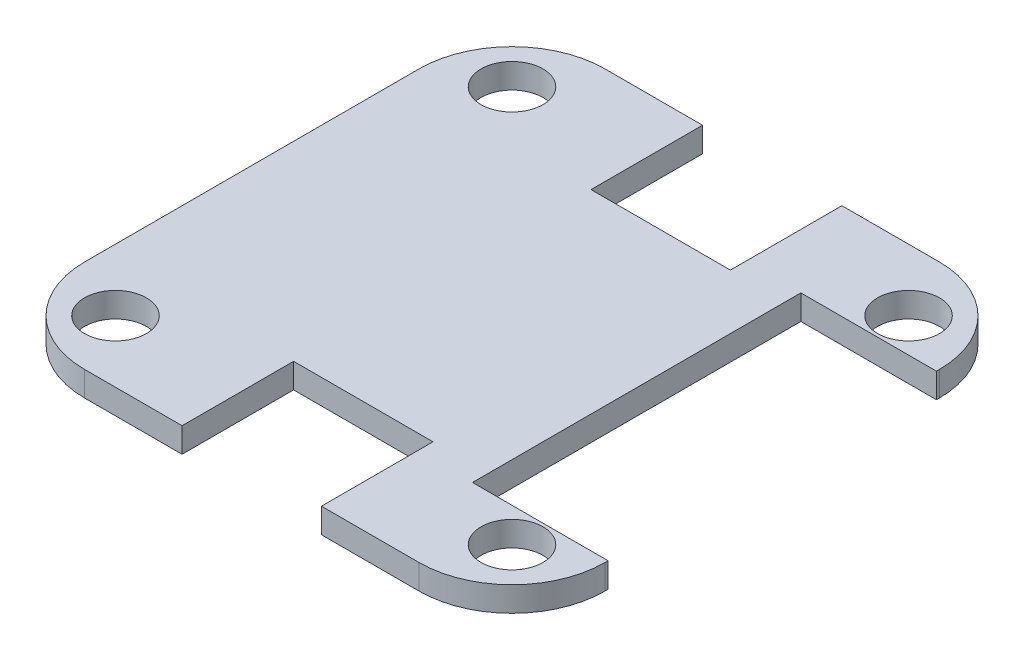
ISO-10303-21;
HEADER;
FILE_DESCRIPTION(('STEP AP214'),'2;1');
FILE_NAME('part.step','',(''),(''),'','','');
FILE_SCHEMA(('AUTOMOTIVE_DESIGN { 1 0 10303 214 1 1 1 1 }'));
ENDSEC;
DATA;
#1=APPLICATION_CONTEXT('core data for automotive mechanical design processes');
#2=APPLICATION_PROTOCOL_DEFINITION('international standard','automotive_design',2000,#1);
#3=PRODUCT_CONTEXT('',#1,'mechanical');
#4=PRODUCT('Part','Part','',(#3));
#5=PRODUCT_RELATED_PRODUCT_CATEGORY('part','',(#4));
#6=PRODUCT_DEFINITION_FORMATION('','',#4);
#7=PRODUCT_DEFINITION_CONTEXT('part definition',#1,'design');
#8=PRODUCT_DEFINITION('design','',#6,#7);
#9=PRODUCT_DEFINITION_SHAPE('','',#8);
#10=(LENGTH_UNIT() NAMED_UNIT(*) SI_UNIT(.MILLI.,.METRE.));
#11=(NAMED_UNIT(*) PLANE_ANGLE_UNIT() SI_UNIT($,.RADIAN.));
#12=(NAMED_UNIT(*) SI_UNIT($,.STERADIAN.) SOLID_ANGLE_UNIT());
#13=UNCERTAINTY_MEASURE_WITH_UNIT(LENGTH_MEASURE(1.E-05),#10,'distance_accuracy_value','');
#14=(GEOMETRIC_REPRESENTATION_CONTEXT(3) GLOBAL_UNCERTAINTY_ASSIGNED_CONTEXT((#13)) GLOBAL_UNIT_ASSIGNED_CONTEXT((#10,
#11,#12)) REPRESENTATION_CONTEXT('',''));
#15=CARTESIAN_POINT('',(0.,0.,0.));
#16=DIRECTION('',(0.,0.,1.));
#17=DIRECTION('',(1.,0.,0.));
#18=AXIS2_PLACEMENT_3D('',#15,#16,#17);
#19=CARTESIAN_POINT('',(42.,4.,0.));
#20=DIRECTION('',(-1.,0.,0.));
#21=DIRECTION('',(0.,0.,1.));
#22=AXIS2_PLACEMENT_3D('',#19,#20,#21);
#23=PLANE('',#22);
#24=DIRECTION('',(0.,1.,0.));
#25=VECTOR('',#24,1.);
#26=CARTESIAN_POINT('',(42.,0.,-26.5));
#27=LINE('',#26,#25);
#28=CARTESIAN_POINT('',(42.,0.,-26.5));
#29=VERTEX_POINT('',#28);
#30=CARTESIAN_POINT('',(42.,4.,-26.5));
#31=VERTEX_POINT('',#30);
#32=EDGE_CURVE('E195',#29,#31,#27,.T.);
#33=ORIENTED_EDGE('',*,*,#32,.F.);
#34=DIRECTION('',(0.,0.,-1.));
#35=VECTOR('',#34,1.);
#36=CARTESIAN_POINT('',(42.,0.,0.));
#37=LINE('',#36,#35);
#38=CARTESIAN_POINT('',(42.,0.,-27.));
#39=VERTEX_POINT('',#38);
#40=EDGE_CURVE('E215',#29,#39,#37,.T.);
#41=ORIENTED_EDGE('',*,*,#40,.T.);
#42=DIRECTION('',(0.,-1.,0.));
#43=VECTOR('',#42,1.);
#44=CARTESIAN_POINT('',(42.,4.,-27.));
#45=LINE('',#44,#43);
#46=CARTESIAN_POINT('',(42.,4.,-27.));
#47=VERTEX_POINT('',#46);
#48=EDGE_CURVE('E242',#47,#39,#45,.T.);
#49=ORIENTED_EDGE('',*,*,#48,.F.);
#50=DIRECTION('',(0.,0.,-1.));
#51=VECTOR('',#50,1.);
#52=CARTESIAN_POINT('',(42.,4.,0.));
#53=LINE('',#52,#51);
#54=EDGE_CURVE('E303',#31,#47,#53,.T.);
#55=ORIENTED_EDGE('',*,*,#54,.F.);
#56=EDGE_LOOP('',(#33,#41,#49,#55));
#57=FACE_BOUND('',#56,.T.);
#58=ADVANCED_FACE('F36',(#57),#23,.F.);
#59=CARTESIAN_POINT('',(0.,4.,0.));
#60=DIRECTION('',(0.,1.,0.));
#61=DIRECTION('',(0.,0.,1.));
#62=AXIS2_PLACEMENT_3D('',#59,#60,#61);
#63=PLANE('',#62);
#64=CARTESIAN_POINT('',(32.0000000000007,4.,32.));
#65=DIRECTION('',(0.,1.,0.));
#66=DIRECTION('',(0.,0.,1.));
#67=AXIS2_PLACEMENT_3D('',#64,#65,#66);
#68=CIRCLE('',#67,5.);
#69=CARTESIAN_POINT('',(32.0000000000007,4.,37.));
#70=VERTEX_POINT('',#69);
#71=EDGE_CURVE('E625',#70,#70,#68,.T.);
#72=ORIENTED_EDGE('',*,*,#71,.F.);
#73=EDGE_LOOP('',(#72));
#74=FACE_BOUND('',#73,.T.);
#75=CARTESIAN_POINT('',(-31.9999999999993,4.,32.));
#76=DIRECTION('',(0.,1.,0.));
#77=DIRECTION('',(0.,0.,1.));
#78=AXIS2_PLACEMENT_3D('',#75,#76,#77);
#79=CIRCLE('',#78,5.);
#80=CARTESIAN_POINT('',(-31.9999999999993,4.,37.));
#81=VERTEX_POINT('',#80);
#82=EDGE_CURVE('E630',#81,#81,#79,.T.);
#83=ORIENTED_EDGE('',*,*,#82,.F.);
#84=EDGE_LOOP('',(#83));
#85=FACE_BOUND('',#84,.T.);
#86=CARTESIAN_POINT('',(-32.,4.,-32.));
#87=DIRECTION('',(0.,1.,0.));
#88=DIRECTION('',(0.,0.,1.));
#89=AXIS2_PLACEMENT_3D('',#86,#87,#88);
#90=CIRCLE('',#89,5.);
#91=CARTESIAN_POINT('',(-32.,4.,-27.));
#92=VERTEX_POINT('',#91);
#93=EDGE_CURVE('E636',#92,#92,#90,.T.);
#94=ORIENTED_EDGE('',*,*,#93,.F.);
#95=EDGE_LOOP('',(#94));
#96=FACE_BOUND('',#95,.T.);
#97=CARTESIAN_POINT('',(32.,4.,-32.));
#98=DIRECTION('',(0.,1.,0.));
#99=DIRECTION('',(0.,0.,1.));
#100=AXIS2_PLACEMENT_3D('',#97,#98,#99);
#101=CIRCLE('',#100,5.);
#102=CARTESIAN_POINT('',(32.,4.,-27.));
#103=VERTEX_POINT('',#102);
#104=EDGE_CURVE('E642',#103,#103,#101,.T.);
#105=ORIENTED_EDGE('',*,*,#104,.F.);
#106=EDGE_LOOP('',(#105));
#107=FACE_BOUND('',#106,.T.);
#108=DIRECTION('',(0.,0.,-1.));
#109=VECTOR('',#108,1.);
#110=CARTESIAN_POINT('',(20.12,4.,0.));
#111=LINE('',#110,#109);
#112=CARTESIAN_POINT('',(20.12,4.,26.5));
#113=VERTEX_POINT('',#112);
#114=CARTESIAN_POINT('',(20.12,4.,-26.5));
#115=VERTEX_POINT('',#114);
#116=EDGE_CURVE('E380',#113,#115,#111,.T.);
#117=ORIENTED_EDGE('',*,*,#116,.T.);
#118=DIRECTION('',(1.,0.,0.));
#119=VECTOR('',#118,1.);
#120=CARTESIAN_POINT('',(0.,4.,-26.5));
#121=LINE('',#120,#119);
#122=EDGE_CURVE('E378',#115,#31,#121,.T.);
#123=ORIENTED_EDGE('',*,*,#122,.T.);
#124=ORIENTED_EDGE('',*,*,#54,.T.);
#125=CARTESIAN_POINT('',(27.,4.,-27.));
#126=DIRECTION('',(0.,1.,0.));
#127=DIRECTION('',(0.,0.,1.));
#128=AXIS2_PLACEMENT_3D('',#125,#126,#127);
#129=CIRCLE('',#128,15.);
#130=CARTESIAN_POINT('',(27.,4.,-42.));
#131=VERTEX_POINT('',#130);
#132=EDGE_CURVE('E307',#131,#47,#129,.F.);
#133=ORIENTED_EDGE('',*,*,#132,.F.);
#134=DIRECTION('',(1.,0.,0.));
#135=VECTOR('',#134,1.);
#136=CARTESIAN_POINT('',(0.,4.,-42.));
#137=LINE('',#136,#135);
#138=CARTESIAN_POINT('',(11.25,4.,-42.));
#139=VERTEX_POINT('',#138);
#140=EDGE_CURVE('E310',#139,#131,#137,.T.);
#141=ORIENTED_EDGE('',*,*,#140,.F.);
#142=DIRECTION('',(0.,0.,1.));
#143=VECTOR('',#142,1.);
#144=CARTESIAN_POINT('',(11.25,4.,0.));
#145=LINE('',#144,#143);
#146=CARTESIAN_POINT('',(11.25,4.,-24.));
#147=VERTEX_POINT('',#146);
#148=EDGE_CURVE('E183',#139,#147,#145,.T.);
#149=ORIENTED_EDGE('',*,*,#148,.T.);
#150=DIRECTION('',(1.,0.,0.));
#151=VECTOR('',#150,1.);
#152=CARTESIAN_POINT('',(0.,4.,-24.));
#153=LINE('',#152,#151);
#154=CARTESIAN_POINT('',(-11.25,4.,-24.));
#155=VERTEX_POINT('',#154);
#156=EDGE_CURVE('E165',#155,#147,#153,.T.);
#157=ORIENTED_EDGE('',*,*,#156,.F.);
#158=DIRECTION('',(0.,0.,1.));
#159=VECTOR('',#158,1.);
#160=CARTESIAN_POINT('',(-11.25,4.,0.));
#161=LINE('',#160,#159);
#162=CARTESIAN_POINT('',(-11.25,4.,-42.));
#163=VERTEX_POINT('',#162);
#164=EDGE_CURVE('E180',#163,#155,#161,.T.);
#165=ORIENTED_EDGE('',*,*,#164,.F.);
#166=DIRECTION('',(1.,0.,0.));
#167=VECTOR('',#166,1.);
#168=CARTESIAN_POINT('',(0.,4.,-42.));
#169=LINE('',#168,#167);
#170=CARTESIAN_POINT('',(-27.,4.,-42.));
#171=VERTEX_POINT('',#170);
#172=EDGE_CURVE('E187',#171,#163,#169,.T.);
#173=ORIENTED_EDGE('',*,*,#172,.F.);
#174=CARTESIAN_POINT('',(-27.,4.,-27.));
#175=DIRECTION('',(0.,1.,0.));
#176=DIRECTION('',(0.,0.,1.));
#177=AXIS2_PLACEMENT_3D('',#174,#175,#176);
#178=CIRCLE('',#177,15.);
#179=CARTESIAN_POINT('',(-42.,4.,-27.));
#180=VERTEX_POINT('',#179);
#181=EDGE_CURVE('E234',#180,#171,#178,.F.);
#182=ORIENTED_EDGE('',*,*,#181,.F.);
#183=DIRECTION('',(0.,0.,-1.));
#184=VECTOR('',#183,1.);
#185=CARTESIAN_POINT('',(-42.,4.,0.));
#186=LINE('',#185,#184);
#187=CARTESIAN_POINT('',(-42.,4.,27.));
#188=VERTEX_POINT('',#187);
#189=EDGE_CURVE('E391',#188,#180,#186,.T.);
#190=ORIENTED_EDGE('',*,*,#189,.F.);
#191=CARTESIAN_POINT('',(-27.,4.,27.));
#192=DIRECTION('',(0.,1.,0.));
#193=DIRECTION('',(0.,0.,1.));
#194=AXIS2_PLACEMENT_3D('',#191,#192,#193);
#195=CIRCLE('',#194,15.);
#196=CARTESIAN_POINT('',(-27.,4.,42.));
#197=VERTEX_POINT('',#196);
#198=EDGE_CURVE('E268',#197,#188,#195,.F.);
#199=ORIENTED_EDGE('',*,*,#198,.F.);
#200=DIRECTION('',(1.,0.,0.));
#201=VECTOR('',#200,1.);
#202=CARTESIAN_POINT('',(0.,4.,42.));
#203=LINE('',#202,#201);
#204=CARTESIAN_POINT('',(-11.25,4.,42.));
#205=VERTEX_POINT('',#204);
#206=EDGE_CURVE('E290',#197,#205,#203,.T.);
#207=ORIENTED_EDGE('',*,*,#206,.T.);
#208=DIRECTION('',(0.,0.,-1.));
#209=VECTOR('',#208,1.);
#210=CARTESIAN_POINT('',(-11.25,4.,0.));
#211=LINE('',#210,#209);
#212=CARTESIAN_POINT('',(-11.25,4.,24.));
#213=VERTEX_POINT('',#212);
#214=EDGE_CURVE('E287',#205,#213,#211,.T.);
#215=ORIENTED_EDGE('',*,*,#214,.T.);
#216=DIRECTION('',(1.,0.,0.));
#217=VECTOR('',#216,1.);
#218=CARTESIAN_POINT('',(0.,4.,24.));
#219=LINE('',#218,#217);
#220=CARTESIAN_POINT('',(11.25,4.,24.));
#221=VERTEX_POINT('',#220);
#222=EDGE_CURVE('E289',#213,#221,#219,.T.);
#223=ORIENTED_EDGE('',*,*,#222,.T.);
#224=DIRECTION('',(0.,0.,-1.));
#225=VECTOR('',#224,1.);
#226=CARTESIAN_POINT('',(11.25,4.,0.));
#227=LINE('',#226,#225);
#228=CARTESIAN_POINT('',(11.25,4.,42.));
#229=VERTEX_POINT('',#228);
#230=EDGE_CURVE('E292',#229,#221,#227,.T.);
#231=ORIENTED_EDGE('',*,*,#230,.F.);
#232=DIRECTION('',(1.,0.,0.));
#233=VECTOR('',#232,1.);
#234=CARTESIAN_POINT('',(0.,4.,42.));
#235=LINE('',#234,#233);
#236=CARTESIAN_POINT('',(27.,4.,42.));
#237=VERTEX_POINT('',#236);
#238=EDGE_CURVE('E299',#229,#237,#235,.T.);
#239=ORIENTED_EDGE('',*,*,#238,.T.);
#240=CARTESIAN_POINT('',(27.,4.,27.));
#241=DIRECTION('',(0.,1.,0.));
#242=DIRECTION('',(0.,0.,1.));
#243=AXIS2_PLACEMENT_3D('',#240,#241,#242);
#244=CIRCLE('',#243,15.);
#245=CARTESIAN_POINT('',(42.,4.,27.));
#246=VERTEX_POINT('',#245);
#247=EDGE_CURVE('E301',#237,#246,#244,.T.);
#248=ORIENTED_EDGE('',*,*,#247,.T.);
#249=CARTESIAN_POINT('',(42.,4.,26.5));
#250=VERTEX_POINT('',#249);
#251=EDGE_CURVE('E304',#246,#250,#53,.T.);
#252=ORIENTED_EDGE('',*,*,#251,.T.);
#253=DIRECTION('',(1.,0.,0.));
#254=VECTOR('',#253,1.);
#255=CARTESIAN_POINT('',(0.,4.,26.5));
#256=LINE('',#255,#254);
#257=EDGE_CURVE('E383',#113,#250,#256,.T.);
#258=ORIENTED_EDGE('',*,*,#257,.F.);
#259=EDGE_LOOP('',(#117,#123,#124,#133,#141,#149,#157,#165,#173,#182,#190,#199,#207,#215,#223,
#231,#239,#248,#252,#258));
#260=FACE_BOUND('',#259,.T.);
#261=ADVANCED_FACE('F178',(#74,#85,#96,#107,#260),#63,.T.);
#262=CARTESIAN_POINT('',(0.,0.,0.));
#263=DIRECTION('',(0.,1.,0.));
#264=DIRECTION('',(0.,0.,1.));
#265=AXIS2_PLACEMENT_3D('',#262,#263,#264);
#266=PLANE('',#265);
#267=CARTESIAN_POINT('',(32.0000000000007,0.,32.));
#268=DIRECTION('',(0.,1.,0.));
#269=DIRECTION('',(0.,0.,1.));
#270=AXIS2_PLACEMENT_3D('',#267,#268,#269);
#271=CIRCLE('',#270,5.);
#272=CARTESIAN_POINT('',(32.0000000000007,0.,37.));
#273=VERTEX_POINT('',#272);
#274=EDGE_CURVE('E628',#273,#273,#271,.T.);
#275=ORIENTED_EDGE('',*,*,#274,.T.);
#276=EDGE_LOOP('',(#275));
#277=FACE_BOUND('',#276,.T.);
#278=CARTESIAN_POINT('',(-31.9999999999993,0.,32.));
#279=DIRECTION('',(0.,1.,0.));
#280=DIRECTION('',(0.,0.,1.));
#281=AXIS2_PLACEMENT_3D('',#278,#279,#280);
#282=CIRCLE('',#281,5.);
#283=CARTESIAN_POINT('',(-31.9999999999993,0.,37.));
#284=VERTEX_POINT('',#283);
#285=EDGE_CURVE('E633',#284,#284,#282,.T.);
#286=ORIENTED_EDGE('',*,*,#285,.T.);
#287=EDGE_LOOP('',(#286));
#288=FACE_BOUND('',#287,.T.);
#289=CARTESIAN_POINT('',(-32.,0.,-32.));
#290=DIRECTION('',(0.,1.,0.));
#291=DIRECTION('',(0.,0.,1.));
#292=AXIS2_PLACEMENT_3D('',#289,#290,#291);
#293=CIRCLE('',#292,5.);
#294=CARTESIAN_POINT('',(-32.,0.,-27.));
#295=VERTEX_POINT('',#294);
#296=EDGE_CURVE('E639',#295,#295,#293,.T.);
#297=ORIENTED_EDGE('',*,*,#296,.T.);
#298=EDGE_LOOP('',(#297));
#299=FACE_BOUND('',#298,.T.);
#300=CARTESIAN_POINT('',(32.,0.,-32.));
#301=DIRECTION('',(0.,1.,0.));
#302=DIRECTION('',(0.,0.,1.));
#303=AXIS2_PLACEMENT_3D('',#300,#301,#302);
#304=CIRCLE('',#303,5.);
#305=CARTESIAN_POINT('',(32.,0.,-27.));
#306=VERTEX_POINT('',#305);
#307=EDGE_CURVE('E381',#306,#306,#304,.T.);
#308=ORIENTED_EDGE('',*,*,#307,.T.);
#309=EDGE_LOOP('',(#308));
#310=FACE_BOUND('',#309,.T.);
#311=DIRECTION('',(1.,0.,0.));
#312=VECTOR('',#311,1.);
#313=CARTESIAN_POINT('',(0.,0.,-26.5));
#314=LINE('',#313,#312);
#315=CARTESIAN_POINT('',(20.12,0.,-26.5));
#316=VERTEX_POINT('',#315);
#317=EDGE_CURVE('E374',#316,#29,#314,.T.);
#318=ORIENTED_EDGE('',*,*,#317,.F.);
#319=DIRECTION('',(0.,0.,-1.));
#320=VECTOR('',#319,1.);
#321=CARTESIAN_POINT('',(20.12,0.,0.));
#322=LINE('',#321,#320);
#323=CARTESIAN_POINT('',(20.12,0.,26.5));
#324=VERTEX_POINT('',#323);
#325=EDGE_CURVE('E368',#324,#316,#322,.T.);
#326=ORIENTED_EDGE('',*,*,#325,.F.);
#327=DIRECTION('',(1.,0.,0.));
#328=VECTOR('',#327,1.);
#329=CARTESIAN_POINT('',(0.,0.,26.5));
#330=LINE('',#329,#328);
#331=CARTESIAN_POINT('',(42.,0.,26.5));
#332=VERTEX_POINT('',#331);
#333=EDGE_CURVE('E51',#324,#332,#330,.T.);
#334=ORIENTED_EDGE('',*,*,#333,.T.);
#335=CARTESIAN_POINT('',(42.,0.,27.));
#336=VERTEX_POINT('',#335);
#337=EDGE_CURVE('E216',#336,#332,#37,.T.);
#338=ORIENTED_EDGE('',*,*,#337,.F.);
#339=CARTESIAN_POINT('',(27.,0.,27.));
#340=DIRECTION('',(0.,1.,0.));
#341=DIRECTION('',(0.,0.,1.));
#342=AXIS2_PLACEMENT_3D('',#339,#340,#341);
#343=CIRCLE('',#342,15.);
#344=CARTESIAN_POINT('',(27.,0.,42.));
#345=VERTEX_POINT('',#344);
#346=EDGE_CURVE('E213',#345,#336,#343,.T.);
#347=ORIENTED_EDGE('',*,*,#346,.F.);
#348=DIRECTION('',(1.,0.,0.));
#349=VECTOR('',#348,1.);
#350=CARTESIAN_POINT('',(0.,0.,42.));
#351=LINE('',#350,#349);
#352=CARTESIAN_POINT('',(11.25,0.,42.));
#353=VERTEX_POINT('',#352);
#354=EDGE_CURVE('E211',#353,#345,#351,.T.);
#355=ORIENTED_EDGE('',*,*,#354,.F.);
#356=DIRECTION('',(0.,0.,-1.));
#357=VECTOR('',#356,1.);
#358=CARTESIAN_POINT('',(11.25,0.,0.));
#359=LINE('',#358,#357);
#360=CARTESIAN_POINT('',(11.25,0.,24.));
#361=VERTEX_POINT('',#360);
#362=EDGE_CURVE('E208',#353,#361,#359,.T.);
#363=ORIENTED_EDGE('',*,*,#362,.T.);
#364=DIRECTION('',(1.,0.,0.));
#365=VECTOR('',#364,1.);
#366=CARTESIAN_POINT('',(0.,0.,24.));
#367=LINE('',#366,#365);
#368=CARTESIAN_POINT('',(-11.25,0.,24.));
#369=VERTEX_POINT('',#368);
#370=EDGE_CURVE('E205',#369,#361,#367,.T.);
#371=ORIENTED_EDGE('',*,*,#370,.F.);
#372=DIRECTION('',(0.,0.,-1.));
#373=VECTOR('',#372,1.);
#374=CARTESIAN_POINT('',(-11.25,0.,0.));
#375=LINE('',#374,#373);
#376=CARTESIAN_POINT('',(-11.25,0.,42.));
#377=VERTEX_POINT('',#376);
#378=EDGE_CURVE('E203',#377,#369,#375,.T.);
#379=ORIENTED_EDGE('',*,*,#378,.F.);
#380=DIRECTION('',(1.,0.,0.));
#381=VECTOR('',#380,1.);
#382=CARTESIAN_POINT('',(0.,0.,42.));
#383=LINE('',#382,#381);
#384=CARTESIAN_POINT('',(-27.,0.,42.));
#385=VERTEX_POINT('',#384);
#386=EDGE_CURVE('E201',#385,#377,#383,.T.);
#387=ORIENTED_EDGE('',*,*,#386,.F.);
#388=CARTESIAN_POINT('',(-27.,0.,27.));
#389=DIRECTION('',(0.,1.,0.));
#390=DIRECTION('',(0.,0.,1.));
#391=AXIS2_PLACEMENT_3D('',#388,#389,#390);
#392=CIRCLE('',#391,15.);
#393=CARTESIAN_POINT('',(-42.,0.,27.));
#394=VERTEX_POINT('',#393);
#395=EDGE_CURVE('E198',#385,#394,#392,.F.);
#396=ORIENTED_EDGE('',*,*,#395,.T.);
#397=DIRECTION('',(0.,0.,-1.));
#398=VECTOR('',#397,1.);
#399=CARTESIAN_POINT('',(-42.,0.,0.));
#400=LINE('',#399,#398);
#401=CARTESIAN_POINT('',(-42.,0.,-27.));
#402=VERTEX_POINT('',#401);
#403=EDGE_CURVE('E194',#394,#402,#400,.T.);
#404=ORIENTED_EDGE('',*,*,#403,.T.);
#405=CARTESIAN_POINT('',(-27.,0.,-27.));
#406=DIRECTION('',(0.,1.,0.));
#407=DIRECTION('',(0.,0.,1.));
#408=AXIS2_PLACEMENT_3D('',#405,#406,#407);
#409=CIRCLE('',#408,15.);
#410=CARTESIAN_POINT('',(-27.,0.,-42.));
#411=VERTEX_POINT('',#410);
#412=EDGE_CURVE('E192',#402,#411,#409,.F.);
#413=ORIENTED_EDGE('',*,*,#412,.T.);
#414=DIRECTION('',(1.,0.,0.));
#415=VECTOR('',#414,1.);
#416=CARTESIAN_POINT('',(0.,0.,-42.));
#417=LINE('',#416,#415);
#418=CARTESIAN_POINT('',(-11.25,0.,-42.));
#419=VERTEX_POINT('',#418);
#420=EDGE_CURVE('E231',#411,#419,#417,.T.);
#421=ORIENTED_EDGE('',*,*,#420,.T.);
#422=DIRECTION('',(0.,0.,1.));
#423=VECTOR('',#422,1.);
#424=CARTESIAN_POINT('',(-11.25,0.,0.));
#425=LINE('',#424,#423);
#426=CARTESIAN_POINT('',(-11.25,0.,-24.));
#427=VERTEX_POINT('',#426);
#428=EDGE_CURVE('E229',#419,#427,#425,.T.);
#429=ORIENTED_EDGE('',*,*,#428,.T.);
#430=DIRECTION('',(1.,0.,0.));
#431=VECTOR('',#430,1.);
#432=CARTESIAN_POINT('',(0.,0.,-24.));
#433=LINE('',#432,#431);
#434=CARTESIAN_POINT('',(11.25,0.,-24.));
#435=VERTEX_POINT('',#434);
#436=EDGE_CURVE('E167',#427,#435,#433,.T.);
#437=ORIENTED_EDGE('',*,*,#436,.T.);
#438=DIRECTION('',(0.,0.,1.));
#439=VECTOR('',#438,1.);
#440=CARTESIAN_POINT('',(11.25,0.,0.));
#441=LINE('',#440,#439);
#442=CARTESIAN_POINT('',(11.25,0.,-42.));
#443=VERTEX_POINT('',#442);
#444=EDGE_CURVE('E225',#443,#435,#441,.T.);
#445=ORIENTED_EDGE('',*,*,#444,.F.);
#446=DIRECTION('',(1.,0.,0.));
#447=VECTOR('',#446,1.);
#448=CARTESIAN_POINT('',(0.,0.,-42.));
#449=LINE('',#448,#447);
#450=CARTESIAN_POINT('',(27.,0.,-42.));
#451=VERTEX_POINT('',#450);
#452=EDGE_CURVE('E222',#443,#451,#449,.T.);
#453=ORIENTED_EDGE('',*,*,#452,.T.);
#454=CARTESIAN_POINT('',(27.,0.,-27.));
#455=DIRECTION('',(0.,1.,0.));
#456=DIRECTION('',(0.,0.,1.));
#457=AXIS2_PLACEMENT_3D('',#454,#455,#456);
#458=CIRCLE('',#457,15.);
#459=EDGE_CURVE('E219',#451,#39,#458,.F.);
#460=ORIENTED_EDGE('',*,*,#459,.T.);
#461=ORIENTED_EDGE('',*,*,#40,.F.);
#462=EDGE_LOOP('',(#318,#326,#334,#338,#347,#355,#363,#371,#379,#387,#396,#404,#413,#421,#429,
#437,#445,#453,#460,#461));
#463=FACE_BOUND('',#462,.T.);
#464=ADVANCED_FACE('F276',(#277,#288,#299,#310,#463),#266,.F.);
#465=CARTESIAN_POINT('',(-27.,4.,-27.));
#466=DIRECTION('',(0.,-1.,0.));
#467=DIRECTION('',(0.,0.,-1.));
#468=AXIS2_PLACEMENT_3D('',#465,#466,#467);
#469=CYLINDRICAL_SURFACE('',#468,15.);
#470=ORIENTED_EDGE('',*,*,#412,.F.);
#471=DIRECTION('',(0.,-1.,0.));
#472=VECTOR('',#471,1.);
#473=CARTESIAN_POINT('',(-42.,4.,-27.));
#474=LINE('',#473,#472);
#475=EDGE_CURVE('E11',#180,#402,#474,.T.);
#476=ORIENTED_EDGE('',*,*,#475,.F.);
#477=ORIENTED_EDGE('',*,*,#181,.T.);
#478=DIRECTION('',(0.,-1.,0.));
#479=VECTOR('',#478,1.);
#480=CARTESIAN_POINT('',(-27.,4.,-42.));
#481=LINE('',#480,#479);
#482=EDGE_CURVE('E60',#171,#411,#481,.T.);
#483=ORIENTED_EDGE('',*,*,#482,.T.);
#484=EDGE_LOOP('',(#470,#476,#477,#483));
#485=FACE_BOUND('',#484,.T.);
#486=ADVANCED_FACE('F38',(#485),#469,.T.);
#487=CARTESIAN_POINT('',(-42.,4.,0.));
#488=DIRECTION('',(-1.,0.,0.));
#489=DIRECTION('',(0.,0.,1.));
#490=AXIS2_PLACEMENT_3D('',#487,#488,#489);
#491=PLANE('',#490);
#492=ORIENTED_EDGE('',*,*,#403,.F.);
#493=DIRECTION('',(0.,-1.,0.));
#494=VECTOR('',#493,1.);
#495=CARTESIAN_POINT('',(-42.,4.,27.));
#496=LINE('',#495,#494);
#497=EDGE_CURVE('E44',#188,#394,#496,.T.);
#498=ORIENTED_EDGE('',*,*,#497,.F.);
#499=ORIENTED_EDGE('',*,*,#189,.T.);
#500=ORIENTED_EDGE('',*,*,#475,.T.);
#501=EDGE_LOOP('',(#492,#498,#499,#500));
#502=FACE_BOUND('',#501,.T.);
#503=ADVANCED_FACE('F272',(#502),#491,.T.);
#504=CARTESIAN_POINT('',(-27.,4.,27.));
#505=DIRECTION('',(0.,-1.,0.));
#506=DIRECTION('',(0.,0.,-1.));
#507=AXIS2_PLACEMENT_3D('',#504,#505,#506);
#508=CYLINDRICAL_SURFACE('',#507,15.);
#509=ORIENTED_EDGE('',*,*,#395,.F.);
#510=DIRECTION('',(0.,-1.,0.));
#511=VECTOR('',#510,1.);
#512=CARTESIAN_POINT('',(-27.,4.,42.));
#513=LINE('',#512,#511);
#514=EDGE_CURVE('E261',#197,#385,#513,.T.);
#515=ORIENTED_EDGE('',*,*,#514,.F.);
#516=ORIENTED_EDGE('',*,*,#198,.T.);
#517=ORIENTED_EDGE('',*,*,#497,.T.);
#518=EDGE_LOOP('',(#509,#515,#516,#517));
#519=FACE_BOUND('',#518,.T.);
#520=ADVANCED_FACE('F266',(#519),#508,.T.);
#521=CARTESIAN_POINT('',(0.,4.,42.));
#522=DIRECTION('',(0.,0.,-1.));
#523=DIRECTION('',(-1.,0.,0.));
#524=AXIS2_PLACEMENT_3D('',#521,#522,#523);
#525=PLANE('',#524);
#526=ORIENTED_EDGE('',*,*,#386,.T.);
#527=DIRECTION('',(0.,-1.,0.));
#528=VECTOR('',#527,1.);
#529=CARTESIAN_POINT('',(-11.25,4.,42.));
#530=LINE('',#529,#528);
#531=EDGE_CURVE('E258',#205,#377,#530,.T.);
#532=ORIENTED_EDGE('',*,*,#531,.F.);
#533=ORIENTED_EDGE('',*,*,#206,.F.);
#534=ORIENTED_EDGE('',*,*,#514,.T.);
#535=EDGE_LOOP('',(#526,#532,#533,#534));
#536=FACE_BOUND('',#535,.T.);
#537=ADVANCED_FACE('F281',(#536),#525,.F.);
#538=CARTESIAN_POINT('',(-11.25,4.,0.));
#539=DIRECTION('',(-1.,0.,0.));
#540=DIRECTION('',(0.,0.,1.));
#541=AXIS2_PLACEMENT_3D('',#538,#539,#540);
#542=PLANE('',#541);
#543=ORIENTED_EDGE('',*,*,#378,.T.);
#544=DIRECTION('',(0.,-1.,0.));
#545=VECTOR('',#544,1.);
#546=CARTESIAN_POINT('',(-11.25,4.,24.));
#547=LINE('',#546,#545);
#548=EDGE_CURVE('E255',#213,#369,#547,.T.);
#549=ORIENTED_EDGE('',*,*,#548,.F.);
#550=ORIENTED_EDGE('',*,*,#214,.F.);
#551=ORIENTED_EDGE('',*,*,#531,.T.);
#552=EDGE_LOOP('',(#543,#549,#550,#551));
#553=FACE_BOUND('',#552,.T.);
#554=ADVANCED_FACE('F285',(#553),#542,.F.);
#555=CARTESIAN_POINT('',(0.,4.,24.));
#556=DIRECTION('',(0.,0.,-1.));
#557=DIRECTION('',(-1.,0.,0.));
#558=AXIS2_PLACEMENT_3D('',#555,#556,#557);
#559=PLANE('',#558);
#560=ORIENTED_EDGE('',*,*,#370,.T.);
#561=DIRECTION('',(0.,-1.,0.));
#562=VECTOR('',#561,1.);
#563=CARTESIAN_POINT('',(11.25,4.,24.));
#564=LINE('',#563,#562);
#565=EDGE_CURVE('E253',#221,#361,#564,.T.);
#566=ORIENTED_EDGE('',*,*,#565,.F.);
#567=ORIENTED_EDGE('',*,*,#222,.F.);
#568=ORIENTED_EDGE('',*,*,#548,.T.);
#569=EDGE_LOOP('',(#560,#566,#567,#568));
#570=FACE_BOUND('',#569,.T.);
#571=ADVANCED_FACE('F556',(#570),#559,.F.);
#572=CARTESIAN_POINT('',(11.25,4.,0.));
#573=DIRECTION('',(-1.,0.,0.));
#574=DIRECTION('',(0.,0.,1.));
#575=AXIS2_PLACEMENT_3D('',#572,#573,#574);
#576=PLANE('',#575);
#577=ORIENTED_EDGE('',*,*,#362,.F.);
#578=DIRECTION('',(0.,-1.,0.));
#579=VECTOR('',#578,1.);
#580=CARTESIAN_POINT('',(11.25,4.,42.));
#581=LINE('',#580,#579);
#582=EDGE_CURVE('E251',#229,#353,#581,.T.);
#583=ORIENTED_EDGE('',*,*,#582,.F.);
#584=ORIENTED_EDGE('',*,*,#230,.T.);
#585=ORIENTED_EDGE('',*,*,#565,.T.);
#586=EDGE_LOOP('',(#577,#583,#584,#585));
#587=FACE_BOUND('',#586,.T.);
#588=ADVANCED_FACE('F546',(#587),#576,.T.);
#589=CARTESIAN_POINT('',(0.,4.,42.));
#590=DIRECTION('',(0.,0.,-1.));
#591=DIRECTION('',(-1.,0.,0.));
#592=AXIS2_PLACEMENT_3D('',#589,#590,#591);
#593=PLANE('',#592);
#594=ORIENTED_EDGE('',*,*,#354,.T.);
#595=DIRECTION('',(0.,-1.,0.));
#596=VECTOR('',#595,1.);
#597=CARTESIAN_POINT('',(27.,4.,42.));
#598=LINE('',#597,#596);
#599=EDGE_CURVE('E248',#237,#345,#598,.T.);
#600=ORIENTED_EDGE('',*,*,#599,.F.);
#601=ORIENTED_EDGE('',*,*,#238,.F.);
#602=ORIENTED_EDGE('',*,*,#582,.T.);
#603=EDGE_LOOP('',(#594,#600,#601,#602));
#604=FACE_BOUND('',#603,.T.);
#605=ADVANCED_FACE('F353',(#604),#593,.F.);
#606=CARTESIAN_POINT('',(27.,4.,27.));
#607=DIRECTION('',(0.,-1.,0.));
#608=DIRECTION('',(0.,0.,-1.));
#609=AXIS2_PLACEMENT_3D('',#606,#607,#608);
#610=CYLINDRICAL_SURFACE('',#609,15.);
#611=ORIENTED_EDGE('',*,*,#346,.T.);
#612=DIRECTION('',(0.,-1.,0.));
#613=VECTOR('',#612,1.);
#614=CARTESIAN_POINT('',(42.,4.,27.));
#615=LINE('',#614,#613);
#616=EDGE_CURVE('E245',#246,#336,#615,.T.);
#617=ORIENTED_EDGE('',*,*,#616,.F.);
#618=ORIENTED_EDGE('',*,*,#247,.F.);
#619=ORIENTED_EDGE('',*,*,#599,.T.);
#620=EDGE_LOOP('',(#611,#617,#618,#619));
#621=FACE_BOUND('',#620,.T.);
#622=ADVANCED_FACE('F347',(#621),#610,.T.);
#623=ORIENTED_EDGE('',*,*,#337,.T.);
#624=DIRECTION('',(0.,1.,0.));
#625=VECTOR('',#624,1.);
#626=CARTESIAN_POINT('',(42.,0.,26.5));
#627=LINE('',#626,#625);
#628=EDGE_CURVE('E360',#332,#250,#627,.T.);
#629=ORIENTED_EDGE('',*,*,#628,.T.);
#630=ORIENTED_EDGE('',*,*,#251,.F.);
#631=ORIENTED_EDGE('',*,*,#616,.T.);
#632=EDGE_LOOP('',(#623,#629,#630,#631));
#633=FACE_BOUND('',#632,.T.);
#634=ADVANCED_FACE('F337',(#633),#23,.F.);
#635=CARTESIAN_POINT('',(27.,4.,-27.));
#636=DIRECTION('',(0.,-1.,0.));
#637=DIRECTION('',(0.,0.,-1.));
#638=AXIS2_PLACEMENT_3D('',#635,#636,#637);
#639=CYLINDRICAL_SURFACE('',#638,15.);
#640=ORIENTED_EDGE('',*,*,#459,.F.);
#641=DIRECTION('',(0.,-1.,0.));
#642=VECTOR('',#641,1.);
#643=CARTESIAN_POINT('',(27.,4.,-42.));
#644=LINE('',#643,#642);
#645=EDGE_CURVE('E240',#131,#451,#644,.T.);
#646=ORIENTED_EDGE('',*,*,#645,.F.);
#647=ORIENTED_EDGE('',*,*,#132,.T.);
#648=ORIENTED_EDGE('',*,*,#48,.T.);
#649=EDGE_LOOP('',(#640,#646,#647,#648));
#650=FACE_BOUND('',#649,.T.);
#651=ADVANCED_FACE('F321',(#650),#639,.T.);
#652=CARTESIAN_POINT('',(0.,4.,-42.));
#653=DIRECTION('',(0.,0.,-1.));
#654=DIRECTION('',(-1.,0.,0.));
#655=AXIS2_PLACEMENT_3D('',#652,#653,#654);
#656=PLANE('',#655);
#657=ORIENTED_EDGE('',*,*,#452,.F.);
#658=DIRECTION('',(0.,-1.,0.));
#659=VECTOR('',#658,1.);
#660=CARTESIAN_POINT('',(11.25,4.,-42.));
#661=LINE('',#660,#659);
#662=EDGE_CURVE('E238',#139,#443,#661,.T.);
#663=ORIENTED_EDGE('',*,*,#662,.F.);
#664=ORIENTED_EDGE('',*,*,#140,.T.);
#665=ORIENTED_EDGE('',*,*,#645,.T.);
#666=EDGE_LOOP('',(#657,#663,#664,#665));
#667=FACE_BOUND('',#666,.T.);
#668=ADVANCED_FACE('F314',(#667),#656,.T.);
#669=CARTESIAN_POINT('',(11.25,4.,0.));
#670=DIRECTION('',(1.,0.,0.));
#671=DIRECTION('',(0.,0.,-1.));
#672=AXIS2_PLACEMENT_3D('',#669,#670,#671);
#673=PLANE('',#672);
#674=ORIENTED_EDGE('',*,*,#444,.T.);
#675=DIRECTION('',(0.,-1.,0.));
#676=VECTOR('',#675,1.);
#677=CARTESIAN_POINT('',(11.25,4.,-24.));
#678=LINE('',#677,#676);
#679=EDGE_CURVE('E172',#147,#435,#678,.T.);
#680=ORIENTED_EDGE('',*,*,#679,.F.);
#681=ORIENTED_EDGE('',*,*,#148,.F.);
#682=ORIENTED_EDGE('',*,*,#662,.T.);
#683=EDGE_LOOP('',(#674,#680,#681,#682));
#684=FACE_BOUND('',#683,.T.);
#685=ADVANCED_FACE('F325',(#684),#673,.F.);
#686=CARTESIAN_POINT('',(0.,4.,-24.));
#687=DIRECTION('',(0.,0.,-1.));
#688=DIRECTION('',(-1.,0.,0.));
#689=AXIS2_PLACEMENT_3D('',#686,#687,#688);
#690=PLANE('',#689);
#691=ORIENTED_EDGE('',*,*,#436,.F.);
#692=DIRECTION('',(0.,-1.,0.));
#693=VECTOR('',#692,1.);
#694=CARTESIAN_POINT('',(-11.25,4.,-24.));
#695=LINE('',#694,#693);
#696=EDGE_CURVE('E162',#155,#427,#695,.T.);
#697=ORIENTED_EDGE('',*,*,#696,.F.);
#698=ORIENTED_EDGE('',*,*,#156,.T.);
#699=ORIENTED_EDGE('',*,*,#679,.T.);
#700=EDGE_LOOP('',(#691,#697,#698,#699));
#701=FACE_BOUND('',#700,.T.);
#702=ADVANCED_FACE('F164',(#701),#690,.T.);
#703=CARTESIAN_POINT('',(-11.25,4.,0.));
#704=DIRECTION('',(1.,0.,0.));
#705=DIRECTION('',(0.,0.,-1.));
#706=AXIS2_PLACEMENT_3D('',#703,#704,#705);
#707=PLANE('',#706);
#708=ORIENTED_EDGE('',*,*,#428,.F.);
#709=DIRECTION('',(0.,-1.,0.));
#710=VECTOR('',#709,1.);
#711=CARTESIAN_POINT('',(-11.25,4.,-42.));
#712=LINE('',#711,#710);
#713=EDGE_CURVE('E173',#163,#419,#712,.T.);
#714=ORIENTED_EDGE('',*,*,#713,.F.);
#715=ORIENTED_EDGE('',*,*,#164,.T.);
#716=ORIENTED_EDGE('',*,*,#696,.T.);
#717=EDGE_LOOP('',(#708,#714,#715,#716));
#718=FACE_BOUND('',#717,.T.);
#719=ADVANCED_FACE('F186',(#718),#707,.T.);
#720=CARTESIAN_POINT('',(0.,4.,-42.));
#721=DIRECTION('',(0.,0.,-1.));
#722=DIRECTION('',(-1.,0.,0.));
#723=AXIS2_PLACEMENT_3D('',#720,#721,#722);
#724=PLANE('',#723);
#725=ORIENTED_EDGE('',*,*,#420,.F.);
#726=ORIENTED_EDGE('',*,*,#482,.F.);
#727=ORIENTED_EDGE('',*,*,#172,.T.);
#728=ORIENTED_EDGE('',*,*,#713,.T.);
#729=EDGE_LOOP('',(#725,#726,#727,#728));
#730=FACE_BOUND('',#729,.T.);
#731=ADVANCED_FACE('F405',(#730),#724,.T.);
#732=CARTESIAN_POINT('',(0.,0.,-26.5));
#733=DIRECTION('',(0.,0.,1.));
#734=DIRECTION('',(1.,0.,0.));
#735=AXIS2_PLACEMENT_3D('',#732,#733,#734);
#736=PLANE('',#735);
#737=ORIENTED_EDGE('',*,*,#122,.F.);
#738=DIRECTION('',(0.,1.,0.));
#739=VECTOR('',#738,1.);
#740=CARTESIAN_POINT('',(20.12,0.,-26.5));
#741=LINE('',#740,#739);
#742=EDGE_CURVE('E369',#316,#115,#741,.T.);
#743=ORIENTED_EDGE('',*,*,#742,.F.);
#744=ORIENTED_EDGE('',*,*,#317,.T.);
#745=ORIENTED_EDGE('',*,*,#32,.T.);
#746=EDGE_LOOP('',(#737,#743,#744,#745));
#747=FACE_BOUND('',#746,.T.);
#748=ADVANCED_FACE('F408',(#747),#736,.T.);
#749=CARTESIAN_POINT('',(0.,0.,26.5));
#750=DIRECTION('',(0.,0.,1.));
#751=DIRECTION('',(1.,0.,0.));
#752=AXIS2_PLACEMENT_3D('',#749,#750,#751);
#753=PLANE('',#752);
#754=ORIENTED_EDGE('',*,*,#257,.T.);
#755=ORIENTED_EDGE('',*,*,#628,.F.);
#756=ORIENTED_EDGE('',*,*,#333,.F.);
#757=DIRECTION('',(0.,1.,0.));
#758=VECTOR('',#757,1.);
#759=CARTESIAN_POINT('',(20.12,0.,26.5));
#760=LINE('',#759,#758);
#761=EDGE_CURVE('E372',#324,#113,#760,.T.);
#762=ORIENTED_EDGE('',*,*,#761,.T.);
#763=EDGE_LOOP('',(#754,#755,#756,#762));
#764=FACE_BOUND('',#763,.T.);
#765=ADVANCED_FACE('F424',(#764),#753,.F.);
#766=CARTESIAN_POINT('',(20.12,0.,0.));
#767=DIRECTION('',(1.,0.,0.));
#768=DIRECTION('',(0.,0.,-1.));
#769=AXIS2_PLACEMENT_3D('',#766,#767,#768);
#770=PLANE('',#769);
#771=ORIENTED_EDGE('',*,*,#116,.F.);
#772=ORIENTED_EDGE('',*,*,#761,.F.);
#773=ORIENTED_EDGE('',*,*,#325,.T.);
#774=ORIENTED_EDGE('',*,*,#742,.T.);
#775=EDGE_LOOP('',(#771,#772,#773,#774));
#776=FACE_BOUND('',#775,.T.);
#777=ADVANCED_FACE('F431',(#776),#770,.T.);
#778=CARTESIAN_POINT('',(32.,0.,-32.));
#779=DIRECTION('',(0.,1.,0.));
#780=DIRECTION('',(0.,0.,1.));
#781=AXIS2_PLACEMENT_3D('',#778,#779,#780);
#782=CYLINDRICAL_SURFACE('',#781,5.);
#783=ORIENTED_EDGE('',*,*,#307,.F.);
#784=EDGE_LOOP('',(#783));
#785=FACE_BOUND('',#784,.T.);
#786=ORIENTED_EDGE('',*,*,#104,.T.);
#787=EDGE_LOOP('',(#786));
#788=FACE_BOUND('',#787,.T.);
#789=ADVANCED_FACE('F438',(#785,#788),#782,.F.);
#790=CARTESIAN_POINT('',(-32.,0.,-32.));
#791=DIRECTION('',(0.,1.,0.));
#792=DIRECTION('',(0.,0.,1.));
#793=AXIS2_PLACEMENT_3D('',#790,#791,#792);
#794=CYLINDRICAL_SURFACE('',#793,5.);
#795=ORIENTED_EDGE('',*,*,#296,.F.);
#796=EDGE_LOOP('',(#795));
#797=FACE_BOUND('',#796,.T.);
#798=ORIENTED_EDGE('',*,*,#93,.T.);
#799=EDGE_LOOP('',(#798));
#800=FACE_BOUND('',#799,.T.);
#801=ADVANCED_FACE('F446',(#797,#800),#794,.F.);
#802=CARTESIAN_POINT('',(-31.9999999999993,0.,32.));
#803=DIRECTION('',(0.,1.,0.));
#804=DIRECTION('',(0.,0.,1.));
#805=AXIS2_PLACEMENT_3D('',#802,#803,#804);
#806=CYLINDRICAL_SURFACE('',#805,5.);
#807=ORIENTED_EDGE('',*,*,#285,.F.);
#808=EDGE_LOOP('',(#807));
#809=FACE_BOUND('',#808,.T.);
#810=ORIENTED_EDGE('',*,*,#82,.T.);
#811=EDGE_LOOP('',(#810));
#812=FACE_BOUND('',#811,.T.);
#813=ADVANCED_FACE('F454',(#809,#812),#806,.F.);
#814=CARTESIAN_POINT('',(32.0000000000007,0.,32.));
#815=DIRECTION('',(0.,1.,0.));
#816=DIRECTION('',(0.,0.,1.));
#817=AXIS2_PLACEMENT_3D('',#814,#815,#816);
#818=CYLINDRICAL_SURFACE('',#817,5.);
#819=ORIENTED_EDGE('',*,*,#274,.F.);
#820=EDGE_LOOP('',(#819));
#821=FACE_BOUND('',#820,.T.);
#822=ORIENTED_EDGE('',*,*,#71,.T.);
#823=EDGE_LOOP('',(#822));
#824=FACE_BOUND('',#823,.T.);
#825=ADVANCED_FACE('F462',(#821,#824),#818,.F.);
#826=CLOSED_SHELL('',(#58,#261,#464,#486,#503,#520,#537,#554,#571,#588,#605,#622,#634,#651,#668,
#685,#702,#719,#731,#748,#765,#777,#789,#801,#813,#825));
#827=MANIFOLD_SOLID_BREP('B2',#826);
#828=ADVANCED_BREP_SHAPE_REPRESENTATION('',(#18,#827),#14);
#829=SHAPE_DEFINITION_REPRESENTATION(#9,#828);
ENDSEC;
END-ISO-10303-21;
